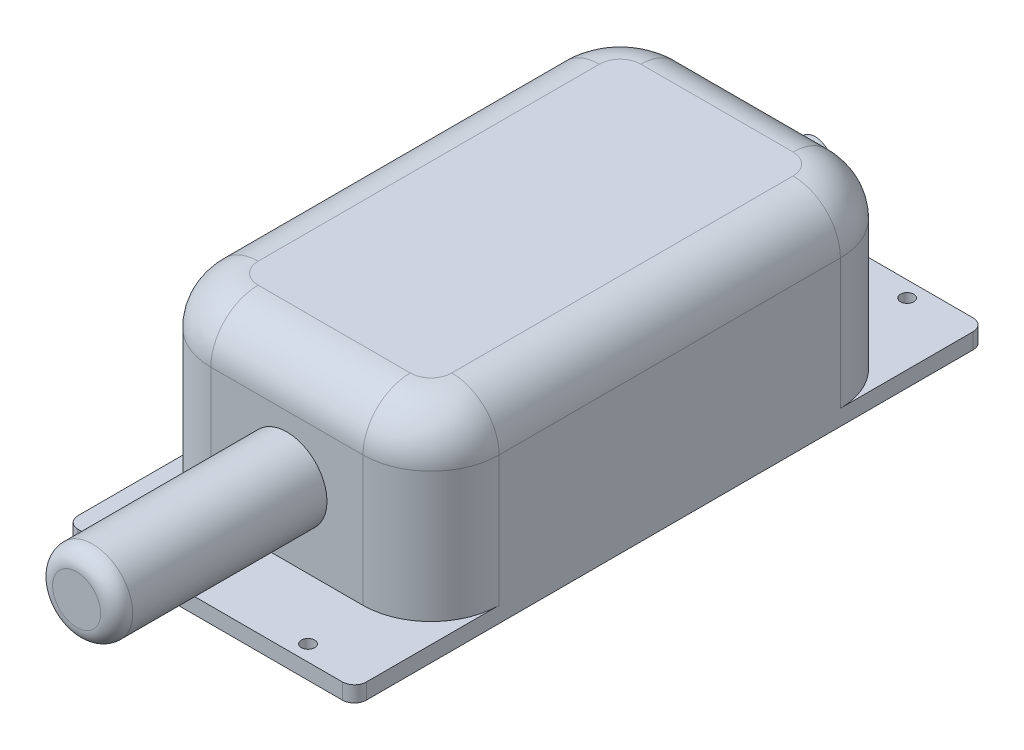
ISO-10303-21;
HEADER;
FILE_DESCRIPTION(('STEP AP214'),'2;1');
FILE_NAME('part.step','',(''),(''),'','','');
FILE_SCHEMA(('AUTOMOTIVE_DESIGN { 1 0 10303 214 1 1 1 1 }'));
ENDSEC;
DATA;
#1=APPLICATION_CONTEXT('core data for automotive mechanical design processes');
#2=APPLICATION_PROTOCOL_DEFINITION('international standard','automotive_design',2000,#1);
#3=PRODUCT_CONTEXT('',#1,'mechanical');
#4=PRODUCT('Part','Part','',(#3));
#5=PRODUCT_RELATED_PRODUCT_CATEGORY('part','',(#4));
#6=PRODUCT_DEFINITION_FORMATION('','',#4);
#7=PRODUCT_DEFINITION_CONTEXT('part definition',#1,'design');
#8=PRODUCT_DEFINITION('design','',#6,#7);
#9=PRODUCT_DEFINITION_SHAPE('','',#8);
#10=(LENGTH_UNIT() NAMED_UNIT(*) SI_UNIT(.MILLI.,.METRE.));
#11=(NAMED_UNIT(*) PLANE_ANGLE_UNIT() SI_UNIT($,.RADIAN.));
#12=(NAMED_UNIT(*) SI_UNIT($,.STERADIAN.) SOLID_ANGLE_UNIT());
#13=UNCERTAINTY_MEASURE_WITH_UNIT(LENGTH_MEASURE(1.E-05),#10,'distance_accuracy_value','');
#14=(GEOMETRIC_REPRESENTATION_CONTEXT(3) GLOBAL_UNCERTAINTY_ASSIGNED_CONTEXT((#13)) GLOBAL_UNIT_ASSIGNED_CONTEXT((#10,
#11,#12)) REPRESENTATION_CONTEXT('',''));
#15=CARTESIAN_POINT('',(0.,0.,0.));
#16=DIRECTION('',(0.,0.,1.));
#17=DIRECTION('',(1.,0.,0.));
#18=AXIS2_PLACEMENT_3D('',#15,#16,#17);
#19=CARTESIAN_POINT('',(0.,5.0038,0.));
#20=DIRECTION('',(0.,1.,0.));
#21=DIRECTION('',(0.,0.,1.));
#22=AXIS2_PLACEMENT_3D('',#19,#20,#21);
#23=PLANE('',#22);
#24=CARTESIAN_POINT('',(-25.9969,5.0038,-94.996));
#25=DIRECTION('',(0.,1.,0.));
#26=DIRECTION('',(0.,0.,-1.));
#27=AXIS2_PLACEMENT_3D('',#24,#25,#26);
#28=CIRCLE('',#27,2.10820000000001);
#29=CARTESIAN_POINT('',(-25.9969,5.0038,-97.1042));
#30=VERTEX_POINT('',#29);
#31=EDGE_CURVE('E410',#30,#30,#28,.T.);
#32=ORIENTED_EDGE('',*,*,#31,.F.);
#33=EDGE_LOOP('',(#32));
#34=FACE_BOUND('',#33,.T.);
#35=CARTESIAN_POINT('',(25.9969,5.0038,-94.996));
#36=DIRECTION('',(0.,1.,0.));
#37=DIRECTION('',(0.,0.,1.));
#38=AXIS2_PLACEMENT_3D('',#35,#36,#37);
#39=CIRCLE('',#38,2.10820000000001);
#40=CARTESIAN_POINT('',(25.9969,5.0038,-92.8878));
#41=VERTEX_POINT('',#40);
#42=EDGE_CURVE('E417',#41,#41,#39,.T.);
#43=ORIENTED_EDGE('',*,*,#42,.F.);
#44=EDGE_LOOP('',(#43));
#45=FACE_BOUND('',#44,.T.);
#46=DIRECTION('',(-1.,0.,0.));
#47=VECTOR('',#46,1.);
#48=CARTESIAN_POINT('',(45.7073,5.0038,-99.9998));
#49=LINE('',#48,#47);
#50=CARTESIAN_POINT('',(41.8973,5.0038,-99.9998));
#51=VERTEX_POINT('',#50);
#52=CARTESIAN_POINT('',(-41.8973,5.0038,-99.9998));
#53=VERTEX_POINT('',#52);
#54=EDGE_CURVE('E234',#51,#53,#49,.T.);
#55=ORIENTED_EDGE('',*,*,#54,.T.);
#56=CARTESIAN_POINT('',(-41.8973,5.0038,-96.1898));
#57=DIRECTION('',(0.,1.,0.));
#58=DIRECTION('',(0.,0.,1.));
#59=AXIS2_PLACEMENT_3D('',#56,#57,#58);
#60=CIRCLE('',#59,3.81);
#61=CARTESIAN_POINT('',(-45.7073,5.0038,-96.1897999999999));
#62=VERTEX_POINT('',#61);
#63=EDGE_CURVE('E340',#53,#62,#60,.T.);
#64=ORIENTED_EDGE('',*,*,#63,.T.);
#65=DIRECTION('',(0.,0.,1.));
#66=VECTOR('',#65,1.);
#67=CARTESIAN_POINT('',(-45.7073,5.0038,99.9998));
#68=LINE('',#67,#66);
#69=CARTESIAN_POINT('',(-45.7073,5.0038,-54.1147));
#70=VERTEX_POINT('',#69);
#71=EDGE_CURVE('E238',#62,#70,#68,.T.);
#72=ORIENTED_EDGE('',*,*,#71,.T.);
#73=CARTESIAN_POINT('',(-24.1173,5.0038,-54.1147));
#74=DIRECTION('',(0.,1.,0.));
#75=DIRECTION('',(0.,0.,-1.));
#76=AXIS2_PLACEMENT_3D('',#73,#74,#75);
#77=CIRCLE('',#76,21.59);
#78=CARTESIAN_POINT('',(-24.1173,5.0038,-75.7047));
#79=VERTEX_POINT('',#78);
#80=EDGE_CURVE('E203',#79,#70,#77,.T.);
#81=ORIENTED_EDGE('',*,*,#80,.F.);
#82=DIRECTION('',(-1.,0.,0.));
#83=VECTOR('',#82,1.);
#84=CARTESIAN_POINT('',(-24.1173,5.0038,-75.7047));
#85=LINE('',#84,#83);
#86=CARTESIAN_POINT('',(24.1172999999999,5.0038,-75.7047));
#87=VERTEX_POINT('',#86);
#88=EDGE_CURVE('E214',#87,#79,#85,.T.);
#89=ORIENTED_EDGE('',*,*,#88,.F.);
#90=CARTESIAN_POINT('',(24.1173,5.0038,-54.1147));
#91=DIRECTION('',(0.,1.,0.));
#92=DIRECTION('',(0.,0.,1.));
#93=AXIS2_PLACEMENT_3D('',#90,#91,#92);
#94=CIRCLE('',#93,21.59);
#95=CARTESIAN_POINT('',(45.7073,5.0038,-54.1147));
#96=VERTEX_POINT('',#95);
#97=EDGE_CURVE('E211',#96,#87,#94,.T.);
#98=ORIENTED_EDGE('',*,*,#97,.F.);
#99=DIRECTION('',(0.,0.,-1.));
#100=VECTOR('',#99,1.);
#101=CARTESIAN_POINT('',(45.7073,5.0038,99.9998));
#102=LINE('',#101,#100);
#103=CARTESIAN_POINT('',(45.7073,5.0038,-96.1898));
#104=VERTEX_POINT('',#103);
#105=EDGE_CURVE('E235',#96,#104,#102,.T.);
#106=ORIENTED_EDGE('',*,*,#105,.T.);
#107=CARTESIAN_POINT('',(41.8973,5.0038,-96.1898));
#108=DIRECTION('',(0.,1.,0.));
#109=DIRECTION('',(0.,0.,1.));
#110=AXIS2_PLACEMENT_3D('',#107,#108,#109);
#111=CIRCLE('',#110,3.81);
#112=EDGE_CURVE('E61',#104,#51,#111,.T.);
#113=ORIENTED_EDGE('',*,*,#112,.T.);
#114=EDGE_LOOP('',(#55,#64,#72,#81,#89,#98,#106,#113));
#115=FACE_BOUND('',#114,.T.);
#116=ADVANCED_FACE('F39',(#34,#45,#115),#23,.T.);
#117=CARTESIAN_POINT('',(45.7073,5.0038,99.9998));
#118=DIRECTION('',(-1.,0.,0.));
#119=DIRECTION('',(0.,0.,1.));
#120=AXIS2_PLACEMENT_3D('',#117,#118,#119);
#121=PLANE('',#120);
#122=CARTESIAN_POINT('',(45.7073,5.0038,96.1898));
#123=VERTEX_POINT('',#122);
#124=CARTESIAN_POINT('',(45.7073,5.0038,54.1147));
#125=VERTEX_POINT('',#124);
#126=EDGE_CURVE('E232',#123,#125,#102,.T.);
#127=ORIENTED_EDGE('',*,*,#126,.F.);
#128=DIRECTION('',(0.,-1.,0.));
#129=VECTOR('',#128,1.);
#130=CARTESIAN_POINT('',(45.7073,5.0038,96.1898));
#131=LINE('',#130,#129);
#132=CARTESIAN_POINT('',(45.7073,0.,96.1898));
#133=VERTEX_POINT('',#132);
#134=EDGE_CURVE('E332',#123,#133,#131,.T.);
#135=ORIENTED_EDGE('',*,*,#134,.T.);
#136=DIRECTION('',(0.,0.,-1.));
#137=VECTOR('',#136,1.);
#138=CARTESIAN_POINT('',(45.7073,0.,99.9998));
#139=LINE('',#138,#137);
#140=CARTESIAN_POINT('',(45.7073,0.,-96.1898));
#141=VERTEX_POINT('',#140);
#142=EDGE_CURVE('E231',#133,#141,#139,.T.);
#143=ORIENTED_EDGE('',*,*,#142,.T.);
#144=DIRECTION('',(0.,-1.,0.));
#145=VECTOR('',#144,1.);
#146=CARTESIAN_POINT('',(45.7073,5.0038,-96.1898));
#147=LINE('',#146,#145);
#148=EDGE_CURVE('E330',#141,#104,#147,.F.);
#149=ORIENTED_EDGE('',*,*,#148,.T.);
#150=ORIENTED_EDGE('',*,*,#105,.F.);
#151=DIRECTION('',(0.,-1.,0.));
#152=VECTOR('',#151,1.);
#153=CARTESIAN_POINT('',(45.7073,61.3156,-54.1146999999998));
#154=LINE('',#153,#152);
#155=CARTESIAN_POINT('',(45.7073,46.3042,-54.1146999999998));
#156=VERTEX_POINT('',#155);
#157=EDGE_CURVE('E221',#156,#96,#154,.T.);
#158=ORIENTED_EDGE('',*,*,#157,.F.);
#159=DIRECTION('',(0.,0.,-1.));
#160=VECTOR('',#159,1.);
#161=CARTESIAN_POINT('',(45.7073,46.3042,99.9998));
#162=LINE('',#161,#160);
#163=CARTESIAN_POINT('',(45.7073,46.3042,54.1147));
#164=VERTEX_POINT('',#163);
#165=EDGE_CURVE('E277',#156,#164,#162,.F.);
#166=ORIENTED_EDGE('',*,*,#165,.T.);
#167=DIRECTION('',(0.,-1.,0.));
#168=VECTOR('',#167,1.);
#169=CARTESIAN_POINT('',(45.7073,61.3156,54.1147));
#170=LINE('',#169,#168);
#171=EDGE_CURVE('E223',#164,#125,#170,.T.);
#172=ORIENTED_EDGE('',*,*,#171,.T.);
#173=EDGE_LOOP('',(#127,#135,#143,#149,#150,#158,#166,#172));
#174=FACE_BOUND('',#173,.T.);
#175=ADVANCED_FACE('F368',(#174),#121,.F.);
#176=CARTESIAN_POINT('',(45.7073,5.0038,-99.9998));
#177=DIRECTION('',(0.,0.,1.));
#178=DIRECTION('',(1.,0.,0.));
#179=AXIS2_PLACEMENT_3D('',#176,#177,#178);
#180=PLANE('',#179);
#181=DIRECTION('',(-1.,0.,0.));
#182=VECTOR('',#181,1.);
#183=CARTESIAN_POINT('',(45.7073,0.,-99.9998));
#184=LINE('',#183,#182);
#185=CARTESIAN_POINT('',(41.8973,0.,-99.9998));
#186=VERTEX_POINT('',#185);
#187=CARTESIAN_POINT('',(-41.8973,0.,-99.9998));
#188=VERTEX_POINT('',#187);
#189=EDGE_CURVE('E246',#186,#188,#184,.T.);
#190=ORIENTED_EDGE('',*,*,#189,.T.);
#191=DIRECTION('',(0.,-1.,0.));
#192=VECTOR('',#191,1.);
#193=CARTESIAN_POINT('',(-41.8973,5.0038,-99.9998));
#194=LINE('',#193,#192);
#195=EDGE_CURVE('E54',#188,#53,#194,.F.);
#196=ORIENTED_EDGE('',*,*,#195,.T.);
#197=ORIENTED_EDGE('',*,*,#54,.F.);
#198=DIRECTION('',(0.,-1.,0.));
#199=VECTOR('',#198,1.);
#200=CARTESIAN_POINT('',(41.8973,5.0038,-99.9998));
#201=LINE('',#200,#199);
#202=EDGE_CURVE('E335',#51,#186,#201,.T.);
#203=ORIENTED_EDGE('',*,*,#202,.T.);
#204=EDGE_LOOP('',(#190,#196,#197,#203));
#205=FACE_BOUND('',#204,.T.);
#206=ADVANCED_FACE('F374',(#205),#180,.F.);
#207=CARTESIAN_POINT('',(-45.7073,5.0038,99.9998));
#208=DIRECTION('',(1.,0.,0.));
#209=DIRECTION('',(0.,0.,-1.));
#210=AXIS2_PLACEMENT_3D('',#207,#208,#209);
#211=PLANE('',#210);
#212=DIRECTION('',(0.,0.,1.));
#213=VECTOR('',#212,1.);
#214=CARTESIAN_POINT('',(-45.7073,0.,99.9998));
#215=LINE('',#214,#213);
#216=CARTESIAN_POINT('',(-45.7073,0.,-96.1897999999999));
#217=VERTEX_POINT('',#216);
#218=CARTESIAN_POINT('',(-45.7073,0.,96.1898));
#219=VERTEX_POINT('',#218);
#220=EDGE_CURVE('E248',#217,#219,#215,.T.);
#221=ORIENTED_EDGE('',*,*,#220,.T.);
#222=DIRECTION('',(0.,-1.,0.));
#223=VECTOR('',#222,1.);
#224=CARTESIAN_POINT('',(-45.7073,5.0038,96.1898));
#225=LINE('',#224,#223);
#226=CARTESIAN_POINT('',(-45.7073,5.0038,96.1898));
#227=VERTEX_POINT('',#226);
#228=EDGE_CURVE('E324',#219,#227,#225,.F.);
#229=ORIENTED_EDGE('',*,*,#228,.T.);
#230=CARTESIAN_POINT('',(-45.7073,5.0038,54.1147));
#231=VERTEX_POINT('',#230);
#232=EDGE_CURVE('E237',#231,#227,#68,.T.);
#233=ORIENTED_EDGE('',*,*,#232,.F.);
#234=DIRECTION('',(0.,-1.,0.));
#235=VECTOR('',#234,1.);
#236=CARTESIAN_POINT('',(-45.7073,61.3156,54.1147));
#237=LINE('',#236,#235);
#238=CARTESIAN_POINT('',(-45.7073,46.3042,54.1147));
#239=VERTEX_POINT('',#238);
#240=EDGE_CURVE('E188',#239,#231,#237,.T.);
#241=ORIENTED_EDGE('',*,*,#240,.F.);
#242=DIRECTION('',(0.,0.,1.));
#243=VECTOR('',#242,1.);
#244=CARTESIAN_POINT('',(-45.7073,46.3042,99.9998));
#245=LINE('',#244,#243);
#246=CARTESIAN_POINT('',(-45.7073,46.3042,-54.1147));
#247=VERTEX_POINT('',#246);
#248=EDGE_CURVE('E284',#239,#247,#245,.F.);
#249=ORIENTED_EDGE('',*,*,#248,.T.);
#250=DIRECTION('',(0.,-1.,0.));
#251=VECTOR('',#250,1.);
#252=CARTESIAN_POINT('',(-45.7073,61.3156,-54.1147));
#253=LINE('',#252,#251);
#254=EDGE_CURVE('E228',#247,#70,#253,.T.);
#255=ORIENTED_EDGE('',*,*,#254,.T.);
#256=ORIENTED_EDGE('',*,*,#71,.F.);
#257=DIRECTION('',(0.,-1.,0.));
#258=VECTOR('',#257,1.);
#259=CARTESIAN_POINT('',(-45.7073,5.0038,-96.1898));
#260=LINE('',#259,#258);
#261=EDGE_CURVE('E321',#62,#217,#260,.T.);
#262=ORIENTED_EDGE('',*,*,#261,.T.);
#263=EDGE_LOOP('',(#221,#229,#233,#241,#249,#255,#256,#262));
#264=FACE_BOUND('',#263,.T.);
#265=ADVANCED_FACE('F391',(#264),#211,.F.);
#266=CARTESIAN_POINT('',(45.7073,5.0038,99.9998));
#267=DIRECTION('',(0.,0.,-1.));
#268=DIRECTION('',(-1.,0.,0.));
#269=AXIS2_PLACEMENT_3D('',#266,#267,#268);
#270=PLANE('',#269);
#271=DIRECTION('',(1.,0.,0.));
#272=VECTOR('',#271,1.);
#273=CARTESIAN_POINT('',(45.7073,5.0038,99.9998));
#274=LINE('',#273,#272);
#275=CARTESIAN_POINT('',(-41.8973,5.0038,99.9998));
#276=VERTEX_POINT('',#275);
#277=CARTESIAN_POINT('',(41.8973,5.0038,99.9998));
#278=VERTEX_POINT('',#277);
#279=EDGE_CURVE('E240',#276,#278,#274,.T.);
#280=ORIENTED_EDGE('',*,*,#279,.F.);
#281=DIRECTION('',(0.,-1.,0.));
#282=VECTOR('',#281,1.);
#283=CARTESIAN_POINT('',(-41.8973,5.0038,99.9998));
#284=LINE('',#283,#282);
#285=CARTESIAN_POINT('',(-41.8973,0.,99.9998));
#286=VERTEX_POINT('',#285);
#287=EDGE_CURVE('E310',#276,#286,#284,.T.);
#288=ORIENTED_EDGE('',*,*,#287,.T.);
#289=DIRECTION('',(1.,0.,0.));
#290=VECTOR('',#289,1.);
#291=CARTESIAN_POINT('',(45.7073,0.,99.9998));
#292=LINE('',#291,#290);
#293=CARTESIAN_POINT('',(41.8973,0.,99.9998));
#294=VERTEX_POINT('',#293);
#295=EDGE_CURVE('E251',#286,#294,#292,.T.);
#296=ORIENTED_EDGE('',*,*,#295,.T.);
#297=DIRECTION('',(0.,-1.,0.));
#298=VECTOR('',#297,1.);
#299=CARTESIAN_POINT('',(41.8973,5.0038,99.9998));
#300=LINE('',#299,#298);
#301=EDGE_CURVE('E286',#294,#278,#300,.F.);
#302=ORIENTED_EDGE('',*,*,#301,.T.);
#303=EDGE_LOOP('',(#280,#288,#296,#302));
#304=FACE_BOUND('',#303,.T.);
#305=ADVANCED_FACE('F383',(#304),#270,.F.);
#306=CARTESIAN_POINT('',(25.9969,5.0038,94.996));
#307=DIRECTION('',(0.,1.,0.));
#308=DIRECTION('',(0.,0.,-1.));
#309=AXIS2_PLACEMENT_3D('',#306,#307,#308);
#310=CIRCLE('',#309,2.10820000000001);
#311=CARTESIAN_POINT('',(25.9969,5.0038,92.8878));
#312=VERTEX_POINT('',#311);
#313=EDGE_CURVE('E397',#312,#312,#310,.T.);
#314=ORIENTED_EDGE('',*,*,#313,.F.);
#315=EDGE_LOOP('',(#314));
#316=FACE_BOUND('',#315,.T.);
#317=CARTESIAN_POINT('',(-25.9969,5.0038,94.996));
#318=DIRECTION('',(0.,1.,0.));
#319=DIRECTION('',(0.,0.,1.));
#320=AXIS2_PLACEMENT_3D('',#317,#318,#319);
#321=CIRCLE('',#320,2.10820000000001);
#322=CARTESIAN_POINT('',(-25.9969,5.0038,97.1042));
#323=VERTEX_POINT('',#322);
#324=EDGE_CURVE('E400',#323,#323,#321,.T.);
#325=ORIENTED_EDGE('',*,*,#324,.F.);
#326=EDGE_LOOP('',(#325));
#327=FACE_BOUND('',#326,.T.);
#328=ORIENTED_EDGE('',*,*,#232,.T.);
#329=CARTESIAN_POINT('',(-41.8973,5.0038,96.1898));
#330=DIRECTION('',(0.,1.,0.));
#331=DIRECTION('',(0.,0.,1.));
#332=AXIS2_PLACEMENT_3D('',#329,#330,#331);
#333=CIRCLE('',#332,3.81);
#334=EDGE_CURVE('E328',#227,#276,#333,.T.);
#335=ORIENTED_EDGE('',*,*,#334,.T.);
#336=ORIENTED_EDGE('',*,*,#279,.T.);
#337=CARTESIAN_POINT('',(41.8973,5.0038,96.1898));
#338=DIRECTION('',(0.,1.,0.));
#339=DIRECTION('',(0.,0.,1.));
#340=AXIS2_PLACEMENT_3D('',#337,#338,#339);
#341=CIRCLE('',#340,3.81);
#342=EDGE_CURVE('E326',#278,#123,#341,.T.);
#343=ORIENTED_EDGE('',*,*,#342,.T.);
#344=ORIENTED_EDGE('',*,*,#126,.T.);
#345=CARTESIAN_POINT('',(24.1173,5.0038,54.1147));
#346=DIRECTION('',(0.,1.,0.));
#347=DIRECTION('',(0.,0.,1.));
#348=AXIS2_PLACEMENT_3D('',#345,#346,#347);
#349=CIRCLE('',#348,21.59);
#350=CARTESIAN_POINT('',(24.1173,5.0038,75.7047));
#351=VERTEX_POINT('',#350);
#352=EDGE_CURVE('E199',#351,#125,#349,.T.);
#353=ORIENTED_EDGE('',*,*,#352,.F.);
#354=DIRECTION('',(1.,0.,0.));
#355=VECTOR('',#354,1.);
#356=CARTESIAN_POINT('',(-24.1173,5.0038,75.7047));
#357=LINE('',#356,#355);
#358=CARTESIAN_POINT('',(-24.1173,5.0038,75.7047));
#359=VERTEX_POINT('',#358);
#360=EDGE_CURVE('E182',#359,#351,#357,.T.);
#361=ORIENTED_EDGE('',*,*,#360,.F.);
#362=CARTESIAN_POINT('',(-24.1173,5.0038,54.1147));
#363=DIRECTION('',(0.,1.,0.));
#364=DIRECTION('',(0.,0.,1.));
#365=AXIS2_PLACEMENT_3D('',#362,#363,#364);
#366=CIRCLE('',#365,21.59);
#367=EDGE_CURVE('E196',#231,#359,#366,.T.);
#368=ORIENTED_EDGE('',*,*,#367,.F.);
#369=EDGE_LOOP('',(#328,#335,#336,#343,#344,#353,#361,#368));
#370=FACE_BOUND('',#369,.T.);
#371=ADVANCED_FACE('F195',(#316,#327,#370),#23,.T.);
#372=CARTESIAN_POINT('',(0.,0.,0.));
#373=DIRECTION('',(0.,1.,0.));
#374=DIRECTION('',(0.,0.,1.));
#375=AXIS2_PLACEMENT_3D('',#372,#373,#374);
#376=PLANE('',#375);
#377=CARTESIAN_POINT('',(-25.9969,0.,-94.996));
#378=DIRECTION('',(0.,1.,0.));
#379=DIRECTION('',(0.,0.,1.));
#380=AXIS2_PLACEMENT_3D('',#377,#378,#379);
#381=CIRCLE('',#380,2.10820000000001);
#382=CARTESIAN_POINT('',(-25.9969,0.,-92.8878));
#383=VERTEX_POINT('',#382);
#384=EDGE_CURVE('E413',#383,#383,#381,.F.);
#385=ORIENTED_EDGE('',*,*,#384,.F.);
#386=EDGE_LOOP('',(#385));
#387=FACE_BOUND('',#386,.T.);
#388=CARTESIAN_POINT('',(25.9969,0.,94.996));
#389=DIRECTION('',(0.,1.,0.));
#390=DIRECTION('',(0.,0.,1.));
#391=AXIS2_PLACEMENT_3D('',#388,#389,#390);
#392=CIRCLE('',#391,2.10820000000001);
#393=CARTESIAN_POINT('',(25.9969,0.,97.1042));
#394=VERTEX_POINT('',#393);
#395=EDGE_CURVE('E414',#394,#394,#392,.F.);
#396=ORIENTED_EDGE('',*,*,#395,.F.);
#397=EDGE_LOOP('',(#396));
#398=FACE_BOUND('',#397,.T.);
#399=CARTESIAN_POINT('',(-25.9969,0.,94.996));
#400=DIRECTION('',(0.,1.,0.));
#401=DIRECTION('',(0.,0.,1.));
#402=AXIS2_PLACEMENT_3D('',#399,#400,#401);
#403=CIRCLE('',#402,2.10820000000001);
#404=CARTESIAN_POINT('',(-25.9969,0.,97.1042));
#405=VERTEX_POINT('',#404);
#406=EDGE_CURVE('E402',#405,#405,#403,.F.);
#407=ORIENTED_EDGE('',*,*,#406,.F.);
#408=EDGE_LOOP('',(#407));
#409=FACE_BOUND('',#408,.T.);
#410=CARTESIAN_POINT('',(25.9969,0.,-94.996));
#411=DIRECTION('',(0.,1.,0.));
#412=DIRECTION('',(0.,0.,1.));
#413=AXIS2_PLACEMENT_3D('',#410,#411,#412);
#414=CIRCLE('',#413,2.10820000000001);
#415=CARTESIAN_POINT('',(25.9969,0.,-92.8878));
#416=VERTEX_POINT('',#415);
#417=EDGE_CURVE('E290',#416,#416,#414,.F.);
#418=ORIENTED_EDGE('',*,*,#417,.F.);
#419=EDGE_LOOP('',(#418));
#420=FACE_BOUND('',#419,.T.);
#421=ORIENTED_EDGE('',*,*,#295,.F.);
#422=CARTESIAN_POINT('',(-41.8973,0.,96.1898));
#423=DIRECTION('',(0.,1.,0.));
#424=DIRECTION('',(0.,0.,1.));
#425=AXIS2_PLACEMENT_3D('',#422,#423,#424);
#426=CIRCLE('',#425,3.81);
#427=EDGE_CURVE('E319',#286,#219,#426,.F.);
#428=ORIENTED_EDGE('',*,*,#427,.T.);
#429=ORIENTED_EDGE('',*,*,#220,.F.);
#430=CARTESIAN_POINT('',(-41.8973,0.,-96.1898));
#431=DIRECTION('',(0.,1.,0.));
#432=DIRECTION('',(0.,0.,1.));
#433=AXIS2_PLACEMENT_3D('',#430,#431,#432);
#434=CIRCLE('',#433,3.81);
#435=EDGE_CURVE('E315',#217,#188,#434,.F.);
#436=ORIENTED_EDGE('',*,*,#435,.T.);
#437=ORIENTED_EDGE('',*,*,#189,.F.);
#438=CARTESIAN_POINT('',(41.8973,0.,-96.1898));
#439=DIRECTION('',(0.,1.,0.));
#440=DIRECTION('',(0.,0.,1.));
#441=AXIS2_PLACEMENT_3D('',#438,#439,#440);
#442=CIRCLE('',#441,3.81);
#443=EDGE_CURVE('E313',#186,#141,#442,.F.);
#444=ORIENTED_EDGE('',*,*,#443,.T.);
#445=ORIENTED_EDGE('',*,*,#142,.F.);
#446=CARTESIAN_POINT('',(41.8973,0.,96.1898));
#447=DIRECTION('',(0.,1.,0.));
#448=DIRECTION('',(0.,0.,1.));
#449=AXIS2_PLACEMENT_3D('',#446,#447,#448);
#450=CIRCLE('',#449,3.81);
#451=EDGE_CURVE('E317',#133,#294,#450,.F.);
#452=ORIENTED_EDGE('',*,*,#451,.T.);
#453=EDGE_LOOP('',(#421,#428,#429,#436,#437,#444,#445,#452));
#454=FACE_BOUND('',#453,.T.);
#455=ADVANCED_FACE('F382',(#387,#398,#409,#420,#454),#376,.F.);
#456=CARTESIAN_POINT('',(-24.1173,61.3156,-54.1147));
#457=DIRECTION('',(0.,-1.,0.));
#458=DIRECTION('',(0.,0.,-1.));
#459=AXIS2_PLACEMENT_3D('',#456,#457,#458);
#460=CYLINDRICAL_SURFACE('',#459,21.59);
#461=ORIENTED_EDGE('',*,*,#254,.F.);
#462=CARTESIAN_POINT('',(-24.1173,46.3042,-54.1147));
#463=DIRECTION('',(0.,-1.,0.));
#464=DIRECTION('',(0.,0.,-1.));
#465=AXIS2_PLACEMENT_3D('',#462,#463,#464);
#466=CIRCLE('',#465,21.59);
#467=CARTESIAN_POINT('',(-24.1173,46.3042,-75.7047));
#468=VERTEX_POINT('',#467);
#469=EDGE_CURVE('E270',#247,#468,#466,.T.);
#470=ORIENTED_EDGE('',*,*,#469,.T.);
#471=DIRECTION('',(0.,-1.,0.));
#472=VECTOR('',#471,1.);
#473=CARTESIAN_POINT('',(-24.1173,61.3156,-75.7047));
#474=LINE('',#473,#472);
#475=EDGE_CURVE('E217',#468,#79,#474,.T.);
#476=ORIENTED_EDGE('',*,*,#475,.T.);
#477=ORIENTED_EDGE('',*,*,#80,.T.);
#478=EDGE_LOOP('',(#461,#470,#476,#477));
#479=FACE_BOUND('',#478,.T.);
#480=ADVANCED_FACE('F389',(#479),#460,.T.);
#481=CARTESIAN_POINT('',(-24.1173,61.3156,54.1147));
#482=DIRECTION('',(0.,-1.,0.));
#483=DIRECTION('',(0.,0.,-1.));
#484=AXIS2_PLACEMENT_3D('',#481,#482,#483);
#485=CYLINDRICAL_SURFACE('',#484,21.59);
#486=DIRECTION('',(0.,-1.,0.));
#487=VECTOR('',#486,1.);
#488=CARTESIAN_POINT('',(-24.1173,61.3156,75.7047));
#489=LINE('',#488,#487);
#490=CARTESIAN_POINT('',(-24.1173,46.3042,75.7047));
#491=VERTEX_POINT('',#490);
#492=EDGE_CURVE('E178',#491,#359,#489,.T.);
#493=ORIENTED_EDGE('',*,*,#492,.F.);
#494=CARTESIAN_POINT('',(-24.1173,46.3042,54.1147));
#495=DIRECTION('',(0.,-1.,0.));
#496=DIRECTION('',(0.,0.,-1.));
#497=AXIS2_PLACEMENT_3D('',#494,#495,#496);
#498=CIRCLE('',#497,21.59);
#499=EDGE_CURVE('E282',#491,#239,#498,.T.);
#500=ORIENTED_EDGE('',*,*,#499,.T.);
#501=ORIENTED_EDGE('',*,*,#240,.T.);
#502=ORIENTED_EDGE('',*,*,#367,.T.);
#503=EDGE_LOOP('',(#493,#500,#501,#502));
#504=FACE_BOUND('',#503,.T.);
#505=ADVANCED_FACE('F201',(#504),#485,.T.);
#506=CARTESIAN_POINT('',(-24.1173,61.3156,75.7047));
#507=DIRECTION('',(0.,0.,-1.));
#508=DIRECTION('',(-1.,0.,0.));
#509=AXIS2_PLACEMENT_3D('',#506,#507,#508);
#510=PLANE('',#509);
#511=CARTESIAN_POINT('',(0.,27.8638,75.7047));
#512=DIRECTION('',(0.,0.,-1.));
#513=DIRECTION('',(-1.,0.,0.));
#514=AXIS2_PLACEMENT_3D('',#511,#512,#513);
#515=CIRCLE('',#514,12.7);
#516=CARTESIAN_POINT('',(-12.7,27.8638,75.7047));
#517=VERTEX_POINT('',#516);
#518=EDGE_CURVE('E342',#517,#517,#515,.F.);
#519=ORIENTED_EDGE('',*,*,#518,.F.);
#520=EDGE_LOOP('',(#519));
#521=FACE_BOUND('',#520,.T.);
#522=DIRECTION('',(0.,-1.,0.));
#523=VECTOR('',#522,1.);
#524=CARTESIAN_POINT('',(24.1173,61.3156,75.7047));
#525=LINE('',#524,#523);
#526=CARTESIAN_POINT('',(24.1173,46.3042,75.7047));
#527=VERTEX_POINT('',#526);
#528=EDGE_CURVE('E189',#527,#351,#525,.T.);
#529=ORIENTED_EDGE('',*,*,#528,.F.);
#530=DIRECTION('',(1.,0.,0.));
#531=VECTOR('',#530,1.);
#532=CARTESIAN_POINT('',(-24.1173,46.3042,75.7047));
#533=LINE('',#532,#531);
#534=EDGE_CURVE('E184',#527,#491,#533,.F.);
#535=ORIENTED_EDGE('',*,*,#534,.T.);
#536=ORIENTED_EDGE('',*,*,#492,.T.);
#537=ORIENTED_EDGE('',*,*,#360,.T.);
#538=EDGE_LOOP('',(#529,#535,#536,#537));
#539=FACE_BOUND('',#538,.T.);
#540=ADVANCED_FACE('F181',(#521,#539),#510,.F.);
#541=CARTESIAN_POINT('',(24.1173,61.3156,54.1147));
#542=DIRECTION('',(0.,-1.,0.));
#543=DIRECTION('',(0.,0.,-1.));
#544=AXIS2_PLACEMENT_3D('',#541,#542,#543);
#545=CYLINDRICAL_SURFACE('',#544,21.59);
#546=ORIENTED_EDGE('',*,*,#171,.F.);
#547=CARTESIAN_POINT('',(24.1173,46.3042,54.1147));
#548=DIRECTION('',(0.,-1.,0.));
#549=DIRECTION('',(0.,0.,-1.));
#550=AXIS2_PLACEMENT_3D('',#547,#548,#549);
#551=CIRCLE('',#550,21.59);
#552=EDGE_CURVE('E279',#164,#527,#551,.T.);
#553=ORIENTED_EDGE('',*,*,#552,.T.);
#554=ORIENTED_EDGE('',*,*,#528,.T.);
#555=ORIENTED_EDGE('',*,*,#352,.T.);
#556=EDGE_LOOP('',(#546,#553,#554,#555));
#557=FACE_BOUND('',#556,.T.);
#558=ADVANCED_FACE('F444',(#557),#545,.T.);
#559=CARTESIAN_POINT('',(24.1173,61.3156,-54.1147));
#560=DIRECTION('',(0.,-1.,0.));
#561=DIRECTION('',(0.,0.,-1.));
#562=AXIS2_PLACEMENT_3D('',#559,#560,#561);
#563=CYLINDRICAL_SURFACE('',#562,21.59);
#564=DIRECTION('',(0.,-1.,0.));
#565=VECTOR('',#564,1.);
#566=CARTESIAN_POINT('',(24.1172999999999,61.3156,-75.7047));
#567=LINE('',#566,#565);
#568=CARTESIAN_POINT('',(24.1172999999999,46.3042,-75.7047));
#569=VERTEX_POINT('',#568);
#570=EDGE_CURVE('E219',#569,#87,#567,.T.);
#571=ORIENTED_EDGE('',*,*,#570,.F.);
#572=CARTESIAN_POINT('',(24.1173,46.3042,-54.1147));
#573=DIRECTION('',(0.,-1.,0.));
#574=DIRECTION('',(0.,0.,-1.));
#575=AXIS2_PLACEMENT_3D('',#572,#573,#574);
#576=CIRCLE('',#575,21.59);
#577=EDGE_CURVE('E275',#569,#156,#576,.T.);
#578=ORIENTED_EDGE('',*,*,#577,.T.);
#579=ORIENTED_EDGE('',*,*,#157,.T.);
#580=ORIENTED_EDGE('',*,*,#97,.T.);
#581=EDGE_LOOP('',(#571,#578,#579,#580));
#582=FACE_BOUND('',#581,.T.);
#583=ADVANCED_FACE('F503',(#582),#563,.T.);
#584=CARTESIAN_POINT('',(-24.1173,61.3156,-75.7047));
#585=DIRECTION('',(0.,0.,1.));
#586=DIRECTION('',(1.,0.,0.));
#587=AXIS2_PLACEMENT_3D('',#584,#585,#586);
#588=PLANE('',#587);
#589=CARTESIAN_POINT('',(0.,32.2698387271885,-75.7047));
#590=DIRECTION('',(0.,0.,1.));
#591=DIRECTION('',(1.,0.,0.));
#592=AXIS2_PLACEMENT_3D('',#589,#590,#591);
#593=CIRCLE('',#592,5.588);
#594=CARTESIAN_POINT('',(5.588,32.2698387271885,-75.7047));
#595=VERTEX_POINT('',#594);
#596=EDGE_CURVE('E11',#595,#595,#593,.F.);
#597=ORIENTED_EDGE('',*,*,#596,.F.);
#598=EDGE_LOOP('',(#597));
#599=FACE_BOUND('',#598,.T.);
#600=ORIENTED_EDGE('',*,*,#475,.F.);
#601=DIRECTION('',(-1.,0.,0.));
#602=VECTOR('',#601,1.);
#603=CARTESIAN_POINT('',(-24.1173,46.3042,-75.7047));
#604=LINE('',#603,#602);
#605=EDGE_CURVE('E273',#468,#569,#604,.F.);
#606=ORIENTED_EDGE('',*,*,#605,.T.);
#607=ORIENTED_EDGE('',*,*,#570,.T.);
#608=ORIENTED_EDGE('',*,*,#88,.T.);
#609=EDGE_LOOP('',(#600,#606,#607,#608));
#610=FACE_BOUND('',#609,.T.);
#611=ADVANCED_FACE('F498',(#599,#610),#588,.F.);
#612=CARTESIAN_POINT('',(-24.1173,61.3156,-54.1147));
#613=DIRECTION('',(0.,-1.,0.));
#614=DIRECTION('',(0.,0.,-1.));
#615=AXIS2_PLACEMENT_3D('',#612,#613,#614);
#616=PLANE('',#615);
#617=DIRECTION('',(-1.,0.,0.));
#618=VECTOR('',#617,1.);
#619=CARTESIAN_POINT('',(-24.1173,61.3156,-60.6933));
#620=LINE('',#619,#618);
#621=CARTESIAN_POINT('',(24.1172999999999,61.3156,-60.6933));
#622=VERTEX_POINT('',#621);
#623=CARTESIAN_POINT('',(-24.1173,61.3156,-60.6933));
#624=VERTEX_POINT('',#623);
#625=EDGE_CURVE('E265',#622,#624,#620,.T.);
#626=ORIENTED_EDGE('',*,*,#625,.T.);
#627=CARTESIAN_POINT('',(-24.1173,61.3156,-54.1147));
#628=DIRECTION('',(0.,-1.,0.));
#629=DIRECTION('',(0.,0.,-1.));
#630=AXIS2_PLACEMENT_3D('',#627,#628,#629);
#631=CIRCLE('',#630,6.5786);
#632=CARTESIAN_POINT('',(-30.6959,61.3156,-54.1147));
#633=VERTEX_POINT('',#632);
#634=EDGE_CURVE('E267',#624,#633,#631,.F.);
#635=ORIENTED_EDGE('',*,*,#634,.T.);
#636=DIRECTION('',(0.,0.,1.));
#637=VECTOR('',#636,1.);
#638=CARTESIAN_POINT('',(-30.6959,61.3156,-54.1147));
#639=LINE('',#638,#637);
#640=CARTESIAN_POINT('',(-30.6959,61.3156,54.1147));
#641=VERTEX_POINT('',#640);
#642=EDGE_CURVE('E243',#633,#641,#639,.T.);
#643=ORIENTED_EDGE('',*,*,#642,.T.);
#644=CARTESIAN_POINT('',(-24.1173,61.3156,54.1147));
#645=DIRECTION('',(0.,-1.,0.));
#646=DIRECTION('',(0.,0.,-1.));
#647=AXIS2_PLACEMENT_3D('',#644,#645,#646);
#648=CIRCLE('',#647,6.5786);
#649=CARTESIAN_POINT('',(-24.1173,61.3156,60.6933));
#650=VERTEX_POINT('',#649);
#651=EDGE_CURVE('E255',#641,#650,#648,.F.);
#652=ORIENTED_EDGE('',*,*,#651,.T.);
#653=DIRECTION('',(1.,0.,0.));
#654=VECTOR('',#653,1.);
#655=CARTESIAN_POINT('',(-24.1173,61.3156,60.6933));
#656=LINE('',#655,#654);
#657=CARTESIAN_POINT('',(24.1173,61.3156,60.6933));
#658=VERTEX_POINT('',#657);
#659=EDGE_CURVE('E257',#650,#658,#656,.T.);
#660=ORIENTED_EDGE('',*,*,#659,.T.);
#661=CARTESIAN_POINT('',(24.1173,61.3156,54.1147));
#662=DIRECTION('',(0.,-1.,0.));
#663=DIRECTION('',(0.,0.,-1.));
#664=AXIS2_PLACEMENT_3D('',#661,#662,#663);
#665=CIRCLE('',#664,6.57860000000001);
#666=CARTESIAN_POINT('',(30.6959,61.3156,54.1147));
#667=VERTEX_POINT('',#666);
#668=EDGE_CURVE('E259',#658,#667,#665,.F.);
#669=ORIENTED_EDGE('',*,*,#668,.T.);
#670=DIRECTION('',(0.,0.,-1.));
#671=VECTOR('',#670,1.);
#672=CARTESIAN_POINT('',(30.6959,61.3156,-54.1147));
#673=LINE('',#672,#671);
#674=CARTESIAN_POINT('',(30.6959,61.3156,-54.1147));
#675=VERTEX_POINT('',#674);
#676=EDGE_CURVE('E261',#667,#675,#673,.T.);
#677=ORIENTED_EDGE('',*,*,#676,.T.);
#678=CARTESIAN_POINT('',(24.1173,61.3156,-54.1147));
#679=DIRECTION('',(0.,-1.,0.));
#680=DIRECTION('',(0.,0.,-1.));
#681=AXIS2_PLACEMENT_3D('',#678,#679,#680);
#682=CIRCLE('',#681,6.5786);
#683=EDGE_CURVE('E263',#675,#622,#682,.F.);
#684=ORIENTED_EDGE('',*,*,#683,.T.);
#685=EDGE_LOOP('',(#626,#635,#643,#652,#660,#669,#677,#684));
#686=FACE_BOUND('',#685,.T.);
#687=ADVANCED_FACE('F515',(#686),#616,.F.);
#688=CARTESIAN_POINT('',(24.1173,46.3042,54.1147));
#689=DIRECTION('',(0.,-1.,0.));
#690=DIRECTION('',(0.,0.,-1.));
#691=AXIS2_PLACEMENT_3D('',#688,#689,#690);
#692=DEGENERATE_TOROIDAL_SURFACE('',#691,6.57860000000001,15.0114,.T.);
#693=CARTESIAN_POINT('',(24.1173,46.3042,60.6933));
#694=DIRECTION('',(-1.,0.,0.));
#695=DIRECTION('',(0.,0.,1.));
#696=AXIS2_PLACEMENT_3D('',#693,#694,#695);
#697=CIRCLE('',#696,15.0114);
#698=EDGE_CURVE('E304',#527,#658,#697,.T.);
#699=ORIENTED_EDGE('',*,*,#698,.F.);
#700=ORIENTED_EDGE('',*,*,#552,.F.);
#701=CARTESIAN_POINT('',(30.6959,46.3042,54.1147));
#702=DIRECTION('',(0.,0.,-1.));
#703=DIRECTION('',(-1.,0.,0.));
#704=AXIS2_PLACEMENT_3D('',#701,#702,#703);
#705=CIRCLE('',#704,15.0114);
#706=EDGE_CURVE('E206',#667,#164,#705,.T.);
#707=ORIENTED_EDGE('',*,*,#706,.F.);
#708=ORIENTED_EDGE('',*,*,#668,.F.);
#709=EDGE_LOOP('',(#699,#700,#707,#708));
#710=FACE_BOUND('',#709,.T.);
#711=ADVANCED_FACE('F448',(#710),#692,.T.);
#712=CARTESIAN_POINT('',(30.6959,46.3042,-54.1147));
#713=DIRECTION('',(0.,0.,-1.));
#714=DIRECTION('',(-1.,0.,0.));
#715=AXIS2_PLACEMENT_3D('',#712,#713,#714);
#716=CYLINDRICAL_SURFACE('',#715,15.0114);
#717=ORIENTED_EDGE('',*,*,#706,.T.);
#718=ORIENTED_EDGE('',*,*,#165,.F.);
#719=CARTESIAN_POINT('',(30.6959,46.3042,-54.1147));
#720=DIRECTION('',(0.,0.,-1.));
#721=DIRECTION('',(-1.,0.,0.));
#722=AXIS2_PLACEMENT_3D('',#719,#720,#721);
#723=CIRCLE('',#722,15.0114);
#724=EDGE_CURVE('E301',#675,#156,#723,.T.);
#725=ORIENTED_EDGE('',*,*,#724,.F.);
#726=ORIENTED_EDGE('',*,*,#676,.F.);
#727=EDGE_LOOP('',(#717,#718,#725,#726));
#728=FACE_BOUND('',#727,.T.);
#729=ADVANCED_FACE('F518',(#728),#716,.T.);
#730=CARTESIAN_POINT('',(-24.1173,46.3042,60.6933));
#731=DIRECTION('',(1.,0.,0.));
#732=DIRECTION('',(0.,0.,-1.));
#733=AXIS2_PLACEMENT_3D('',#730,#731,#732);
#734=CYLINDRICAL_SURFACE('',#733,15.0114);
#735=ORIENTED_EDGE('',*,*,#698,.T.);
#736=ORIENTED_EDGE('',*,*,#659,.F.);
#737=CARTESIAN_POINT('',(-24.1173,46.3042,60.6933));
#738=DIRECTION('',(-1.,0.,0.));
#739=DIRECTION('',(0.,0.,1.));
#740=AXIS2_PLACEMENT_3D('',#737,#738,#739);
#741=CIRCLE('',#740,15.0114);
#742=EDGE_CURVE('E298',#491,#650,#741,.T.);
#743=ORIENTED_EDGE('',*,*,#742,.F.);
#744=ORIENTED_EDGE('',*,*,#534,.F.);
#745=EDGE_LOOP('',(#735,#736,#743,#744));
#746=FACE_BOUND('',#745,.T.);
#747=ADVANCED_FACE('F452',(#746),#734,.T.);
#748=CARTESIAN_POINT('',(24.1173,46.3042,-54.1147));
#749=DIRECTION('',(0.,-1.,0.));
#750=DIRECTION('',(0.,0.,-1.));
#751=AXIS2_PLACEMENT_3D('',#748,#749,#750);
#752=DEGENERATE_TOROIDAL_SURFACE('',#751,6.5786,15.0114,.T.);
#753=ORIENTED_EDGE('',*,*,#724,.T.);
#754=ORIENTED_EDGE('',*,*,#577,.F.);
#755=CARTESIAN_POINT('',(24.1172999999999,46.3042,-60.6933));
#756=DIRECTION('',(-1.,0.,0.));
#757=DIRECTION('',(0.,0.,1.));
#758=AXIS2_PLACEMENT_3D('',#755,#756,#757);
#759=CIRCLE('',#758,15.0114);
#760=EDGE_CURVE('E295',#622,#569,#759,.T.);
#761=ORIENTED_EDGE('',*,*,#760,.F.);
#762=ORIENTED_EDGE('',*,*,#683,.F.);
#763=EDGE_LOOP('',(#753,#754,#761,#762));
#764=FACE_BOUND('',#763,.T.);
#765=ADVANCED_FACE('F506',(#764),#752,.T.);
#766=CARTESIAN_POINT('',(-24.1173,46.3042,54.1147));
#767=DIRECTION('',(0.,-1.,0.));
#768=DIRECTION('',(0.,0.,-1.));
#769=AXIS2_PLACEMENT_3D('',#766,#767,#768);
#770=DEGENERATE_TOROIDAL_SURFACE('',#769,6.5786,15.0114,.T.);
#771=ORIENTED_EDGE('',*,*,#742,.T.);
#772=ORIENTED_EDGE('',*,*,#651,.F.);
#773=CARTESIAN_POINT('',(-30.6959,46.3042,54.1147));
#774=DIRECTION('',(0.,0.,-1.));
#775=DIRECTION('',(-1.,0.,0.));
#776=AXIS2_PLACEMENT_3D('',#773,#774,#775);
#777=CIRCLE('',#776,15.0114);
#778=EDGE_CURVE('E292',#239,#641,#777,.T.);
#779=ORIENTED_EDGE('',*,*,#778,.F.);
#780=ORIENTED_EDGE('',*,*,#499,.F.);
#781=EDGE_LOOP('',(#771,#772,#779,#780));
#782=FACE_BOUND('',#781,.T.);
#783=ADVANCED_FACE('F457',(#782),#770,.T.);
#784=CARTESIAN_POINT('',(-24.1173,46.3042,-60.6933));
#785=DIRECTION('',(-1.,0.,0.));
#786=DIRECTION('',(0.,0.,1.));
#787=AXIS2_PLACEMENT_3D('',#784,#785,#786);
#788=CYLINDRICAL_SURFACE('',#787,15.0114);
#789=ORIENTED_EDGE('',*,*,#760,.T.);
#790=ORIENTED_EDGE('',*,*,#605,.F.);
#791=CARTESIAN_POINT('',(-24.1173,46.3042,-60.6933));
#792=DIRECTION('',(-1.,0.,0.));
#793=DIRECTION('',(0.,0.,1.));
#794=AXIS2_PLACEMENT_3D('',#791,#792,#793);
#795=CIRCLE('',#794,15.0114);
#796=EDGE_CURVE('E289',#624,#468,#795,.T.);
#797=ORIENTED_EDGE('',*,*,#796,.F.);
#798=ORIENTED_EDGE('',*,*,#625,.F.);
#799=EDGE_LOOP('',(#789,#790,#797,#798));
#800=FACE_BOUND('',#799,.T.);
#801=ADVANCED_FACE('F511',(#800),#788,.T.);
#802=CARTESIAN_POINT('',(-30.6959,46.3042,-54.1147));
#803=DIRECTION('',(0.,0.,1.));
#804=DIRECTION('',(1.,0.,0.));
#805=AXIS2_PLACEMENT_3D('',#802,#803,#804);
#806=CYLINDRICAL_SURFACE('',#805,15.0114);
#807=ORIENTED_EDGE('',*,*,#778,.T.);
#808=ORIENTED_EDGE('',*,*,#642,.F.);
#809=CARTESIAN_POINT('',(-30.6959,46.3042,-54.1147));
#810=DIRECTION('',(0.,0.,-1.));
#811=DIRECTION('',(-1.,0.,0.));
#812=AXIS2_PLACEMENT_3D('',#809,#810,#811);
#813=CIRCLE('',#812,15.0114);
#814=EDGE_CURVE('E287',#247,#633,#813,.T.);
#815=ORIENTED_EDGE('',*,*,#814,.F.);
#816=ORIENTED_EDGE('',*,*,#248,.F.);
#817=EDGE_LOOP('',(#807,#808,#815,#816));
#818=FACE_BOUND('',#817,.T.);
#819=ADVANCED_FACE('F532',(#818),#806,.T.);
#820=CARTESIAN_POINT('',(-24.1173,46.3042,-54.1147));
#821=DIRECTION('',(0.,-1.,0.));
#822=DIRECTION('',(0.,0.,-1.));
#823=AXIS2_PLACEMENT_3D('',#820,#821,#822);
#824=DEGENERATE_TOROIDAL_SURFACE('',#823,6.5786,15.0114,.T.);
#825=ORIENTED_EDGE('',*,*,#796,.T.);
#826=ORIENTED_EDGE('',*,*,#469,.F.);
#827=ORIENTED_EDGE('',*,*,#814,.T.);
#828=ORIENTED_EDGE('',*,*,#634,.F.);
#829=EDGE_LOOP('',(#825,#826,#827,#828));
#830=FACE_BOUND('',#829,.T.);
#831=ADVANCED_FACE('F535',(#830),#824,.T.);
#832=CARTESIAN_POINT('',(25.9969,-0.00100000000000013,-94.996));
#833=DIRECTION('',(0.,1.,0.));
#834=DIRECTION('',(0.,0.,1.));
#835=AXIS2_PLACEMENT_3D('',#832,#833,#834);
#836=CYLINDRICAL_SURFACE('',#835,2.10820000000001);
#837=ORIENTED_EDGE('',*,*,#42,.T.);
#838=EDGE_LOOP('',(#837));
#839=FACE_BOUND('',#838,.T.);
#840=ORIENTED_EDGE('',*,*,#417,.T.);
#841=EDGE_LOOP('',(#840));
#842=FACE_BOUND('',#841,.T.);
#843=ADVANCED_FACE('F425',(#839,#842),#836,.F.);
#844=CARTESIAN_POINT('',(-25.9969,-0.00100000000000013,94.996));
#845=DIRECTION('',(0.,1.,0.));
#846=DIRECTION('',(0.,0.,1.));
#847=AXIS2_PLACEMENT_3D('',#844,#845,#846);
#848=CYLINDRICAL_SURFACE('',#847,2.10820000000001);
#849=ORIENTED_EDGE('',*,*,#324,.T.);
#850=EDGE_LOOP('',(#849));
#851=FACE_BOUND('',#850,.T.);
#852=ORIENTED_EDGE('',*,*,#406,.T.);
#853=EDGE_LOOP('',(#852));
#854=FACE_BOUND('',#853,.T.);
#855=ADVANCED_FACE('F709',(#851,#854),#848,.F.);
#856=CARTESIAN_POINT('',(25.9969,-0.00100000000000013,94.996));
#857=DIRECTION('',(0.,1.,0.));
#858=DIRECTION('',(0.,0.,1.));
#859=AXIS2_PLACEMENT_3D('',#856,#857,#858);
#860=CYLINDRICAL_SURFACE('',#859,2.10820000000001);
#861=ORIENTED_EDGE('',*,*,#313,.T.);
#862=EDGE_LOOP('',(#861));
#863=FACE_BOUND('',#862,.T.);
#864=ORIENTED_EDGE('',*,*,#395,.T.);
#865=EDGE_LOOP('',(#864));
#866=FACE_BOUND('',#865,.T.);
#867=ADVANCED_FACE('F474',(#863,#866),#860,.F.);
#868=CARTESIAN_POINT('',(-25.9969,-0.00100000000000013,-94.996));
#869=DIRECTION('',(0.,1.,0.));
#870=DIRECTION('',(0.,0.,1.));
#871=AXIS2_PLACEMENT_3D('',#868,#869,#870);
#872=CYLINDRICAL_SURFACE('',#871,2.10820000000001);
#873=ORIENTED_EDGE('',*,*,#31,.T.);
#874=EDGE_LOOP('',(#873));
#875=FACE_BOUND('',#874,.T.);
#876=ORIENTED_EDGE('',*,*,#384,.T.);
#877=EDGE_LOOP('',(#876));
#878=FACE_BOUND('',#877,.T.);
#879=ADVANCED_FACE('F466',(#875,#878),#872,.F.);
#880=CARTESIAN_POINT('',(-41.8973,5.0038,96.1898));
#881=DIRECTION('',(0.,-1.,0.));
#882=DIRECTION('',(0.,0.,-1.));
#883=AXIS2_PLACEMENT_3D('',#880,#881,#882);
#884=CYLINDRICAL_SURFACE('',#883,3.81);
#885=ORIENTED_EDGE('',*,*,#334,.F.);
#886=ORIENTED_EDGE('',*,*,#228,.F.);
#887=ORIENTED_EDGE('',*,*,#427,.F.);
#888=ORIENTED_EDGE('',*,*,#287,.F.);
#889=EDGE_LOOP('',(#885,#886,#887,#888));
#890=FACE_BOUND('',#889,.T.);
#891=ADVANCED_FACE('F464',(#890),#884,.T.);
#892=CARTESIAN_POINT('',(41.8973,5.0038,96.1898));
#893=DIRECTION('',(0.,-1.,0.));
#894=DIRECTION('',(0.,0.,-1.));
#895=AXIS2_PLACEMENT_3D('',#892,#893,#894);
#896=CYLINDRICAL_SURFACE('',#895,3.81);
#897=ORIENTED_EDGE('',*,*,#342,.F.);
#898=ORIENTED_EDGE('',*,*,#301,.F.);
#899=ORIENTED_EDGE('',*,*,#451,.F.);
#900=ORIENTED_EDGE('',*,*,#134,.F.);
#901=EDGE_LOOP('',(#897,#898,#899,#900));
#902=FACE_BOUND('',#901,.T.);
#903=ADVANCED_FACE('F436',(#902),#896,.T.);
#904=CARTESIAN_POINT('',(-41.8973,5.0038,-96.1898));
#905=DIRECTION('',(0.,-1.,0.));
#906=DIRECTION('',(0.,0.,-1.));
#907=AXIS2_PLACEMENT_3D('',#904,#905,#906);
#908=CYLINDRICAL_SURFACE('',#907,3.81);
#909=ORIENTED_EDGE('',*,*,#63,.F.);
#910=ORIENTED_EDGE('',*,*,#195,.F.);
#911=ORIENTED_EDGE('',*,*,#435,.F.);
#912=ORIENTED_EDGE('',*,*,#261,.F.);
#913=EDGE_LOOP('',(#909,#910,#911,#912));
#914=FACE_BOUND('',#913,.T.);
#915=ADVANCED_FACE('F472',(#914),#908,.T.);
#916=CARTESIAN_POINT('',(41.8973,5.0038,-96.1898));
#917=DIRECTION('',(0.,-1.,0.));
#918=DIRECTION('',(0.,0.,-1.));
#919=AXIS2_PLACEMENT_3D('',#916,#917,#918);
#920=CYLINDRICAL_SURFACE('',#919,3.81);
#921=ORIENTED_EDGE('',*,*,#112,.F.);
#922=ORIENTED_EDGE('',*,*,#148,.F.);
#923=ORIENTED_EDGE('',*,*,#443,.F.);
#924=ORIENTED_EDGE('',*,*,#202,.F.);
#925=EDGE_LOOP('',(#921,#922,#923,#924));
#926=FACE_BOUND('',#925,.T.);
#927=ADVANCED_FACE('F364',(#926),#920,.T.);
#928=CARTESIAN_POINT('',(0.,27.8638,142.3797));
#929=DIRECTION('',(0.,0.,-1.));
#930=DIRECTION('',(-1.,0.,0.));
#931=AXIS2_PLACEMENT_3D('',#928,#929,#930);
#932=CYLINDRICAL_SURFACE('',#931,12.7);
#933=CARTESIAN_POINT('',(0.,27.8638,137.2997));
#934=DIRECTION('',(0.,0.,1.));
#935=DIRECTION('',(1.,0.,0.));
#936=AXIS2_PLACEMENT_3D('',#933,#934,#935);
#937=CIRCLE('',#936,12.7);
#938=CARTESIAN_POINT('',(12.7,27.8638,137.2997));
#939=VERTEX_POINT('',#938);
#940=EDGE_CURVE('E47',#939,#939,#937,.F.);
#941=ORIENTED_EDGE('',*,*,#940,.T.);
#942=EDGE_LOOP('',(#941));
#943=FACE_BOUND('',#942,.T.);
#944=ORIENTED_EDGE('',*,*,#518,.T.);
#945=EDGE_LOOP('',(#944));
#946=FACE_BOUND('',#945,.T.);
#947=ADVANCED_FACE('F350',(#943,#946),#932,.T.);
#948=CARTESIAN_POINT('',(0.,27.8638,142.3797));
#949=DIRECTION('',(0.,0.,1.));
#950=DIRECTION('',(1.,0.,0.));
#951=AXIS2_PLACEMENT_3D('',#948,#949,#950);
#952=PLANE('',#951);
#953=CARTESIAN_POINT('',(0.,27.8638,142.3797));
#954=DIRECTION('',(0.,0.,1.));
#955=DIRECTION('',(1.,0.,0.));
#956=AXIS2_PLACEMENT_3D('',#953,#954,#955);
#957=CIRCLE('',#956,7.62);
#958=CARTESIAN_POINT('',(7.62,27.8638,142.3797));
#959=VERTEX_POINT('',#958);
#960=EDGE_CURVE('E345',#959,#959,#957,.T.);
#961=ORIENTED_EDGE('',*,*,#960,.T.);
#962=EDGE_LOOP('',(#961));
#963=FACE_BOUND('',#962,.T.);
#964=ADVANCED_FACE('F356',(#963),#952,.T.);
#965=CARTESIAN_POINT('',(0.,27.8638,137.2997));
#966=DIRECTION('',(0.,0.,1.));
#967=DIRECTION('',(1.,0.,0.));
#968=AXIS2_PLACEMENT_3D('',#965,#966,#967);
#969=TOROIDAL_SURFACE('',#968,7.62,5.08);
#970=ORIENTED_EDGE('',*,*,#940,.F.);
#971=EDGE_LOOP('',(#970));
#972=FACE_BOUND('',#971,.T.);
#973=ORIENTED_EDGE('',*,*,#960,.F.);
#974=EDGE_LOOP('',(#973));
#975=FACE_BOUND('',#974,.T.);
#976=ADVANCED_FACE('F41',(#972,#975),#969,.T.);
#977=CARTESIAN_POINT('',(0.,32.2698387271885,-91.8591));
#978=DIRECTION('',(0.,0.,1.));
#979=DIRECTION('',(1.,0.,0.));
#980=AXIS2_PLACEMENT_3D('',#977,#978,#979);
#981=CYLINDRICAL_SURFACE('',#980,5.588);
#982=CARTESIAN_POINT('',(0.,32.2698387271885,-91.8591));
#983=DIRECTION('',(0.,0.,-1.));
#984=DIRECTION('',(-1.,0.,0.));
#985=AXIS2_PLACEMENT_3D('',#982,#983,#984);
#986=CIRCLE('',#985,5.588);
#987=CARTESIAN_POINT('',(-5.588,32.2698387271885,-91.8591));
#988=VERTEX_POINT('',#987);
#989=EDGE_CURVE('E403',#988,#988,#986,.T.);
#990=ORIENTED_EDGE('',*,*,#989,.F.);
#991=EDGE_LOOP('',(#990));
#992=FACE_BOUND('',#991,.T.);
#993=ORIENTED_EDGE('',*,*,#596,.T.);
#994=EDGE_LOOP('',(#993));
#995=FACE_BOUND('',#994,.T.);
#996=ADVANCED_FACE('F355',(#992,#995),#981,.T.);
#997=CARTESIAN_POINT('',(0.,32.2698387271885,-91.8591));
#998=DIRECTION('',(0.,0.,-1.));
#999=DIRECTION('',(-1.,0.,0.));
#1000=AXIS2_PLACEMENT_3D('',#997,#998,#999);
#1001=PLANE('',#1000);
#1002=ORIENTED_EDGE('',*,*,#989,.T.);
#1003=EDGE_LOOP('',(#1002));
#1004=FACE_BOUND('',#1003,.T.);
#1005=ADVANCED_FACE('F636',(#1004),#1001,.T.);
#1006=CLOSED_SHELL('',(#116,#175,#206,#265,#305,#371,#455,#480,#505,#540,#558,#583,#611,#687,
#711,#729,#747,#765,#783,#801,#819,#831,#843,#855,#867,#879,#891,#903,#915,#927,#947,#964,#976,
#996,#1005));
#1007=MANIFOLD_SOLID_BREP('B2',#1006);
#1008=ADVANCED_BREP_SHAPE_REPRESENTATION('',(#18,#1007),#14);
#1009=SHAPE_DEFINITION_REPRESENTATION(#9,#1008);
ENDSEC;
END-ISO-10303-21;
